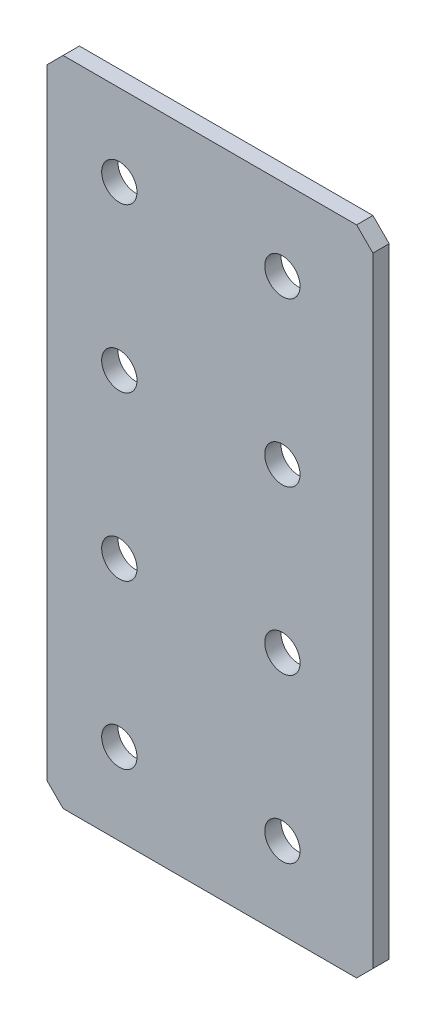
ISO-10303-21;
HEADER;
FILE_DESCRIPTION(('STEP AP214'),'2;1');
FILE_NAME('part.step','',(''),(''),'','','');
FILE_SCHEMA(('AUTOMOTIVE_DESIGN { 1 0 10303 214 1 1 1 1 }'));
ENDSEC;
DATA;
#1=APPLICATION_CONTEXT('core data for automotive mechanical design processes');
#2=APPLICATION_PROTOCOL_DEFINITION('international standard','automotive_design',2000,#1);
#3=PRODUCT_CONTEXT('',#1,'mechanical');
#4=PRODUCT('Part','Part','',(#3));
#5=PRODUCT_RELATED_PRODUCT_CATEGORY('part','',(#4));
#6=PRODUCT_DEFINITION_FORMATION('','',#4);
#7=PRODUCT_DEFINITION_CONTEXT('part definition',#1,'design');
#8=PRODUCT_DEFINITION('design','',#6,#7);
#9=PRODUCT_DEFINITION_SHAPE('','',#8);
#10=(LENGTH_UNIT() NAMED_UNIT(*) SI_UNIT(.MILLI.,.METRE.));
#11=(NAMED_UNIT(*) PLANE_ANGLE_UNIT() SI_UNIT($,.RADIAN.));
#12=(NAMED_UNIT(*) SI_UNIT($,.STERADIAN.) SOLID_ANGLE_UNIT());
#13=UNCERTAINTY_MEASURE_WITH_UNIT(LENGTH_MEASURE(1.E-05),#10,'distance_accuracy_value','');
#14=(GEOMETRIC_REPRESENTATION_CONTEXT(3) GLOBAL_UNCERTAINTY_ASSIGNED_CONTEXT((#13)) GLOBAL_UNIT_ASSIGNED_CONTEXT((#10,
#11,#12)) REPRESENTATION_CONTEXT('',''));
#15=CARTESIAN_POINT('',(0.,0.,0.));
#16=DIRECTION('',(0.,0.,1.));
#17=DIRECTION('',(1.,0.,0.));
#18=AXIS2_PLACEMENT_3D('',#15,#16,#17);
#19=CARTESIAN_POINT('',(0.,0.,3.));
#20=DIRECTION('',(0.,0.,1.));
#21=DIRECTION('',(1.,0.,0.));
#22=AXIS2_PLACEMENT_3D('',#19,#20,#21);
#23=PLANE('',#22);
#24=CARTESIAN_POINT('',(-4.28198785338893,-53.1565274478296,3.));
#25=DIRECTION('',(0.,0.,1.));
#26=DIRECTION('',(1.,0.,0.));
#27=AXIS2_PLACEMENT_3D('',#24,#25,#26);
#28=CIRCLE('',#27,3.25);
#29=CARTESIAN_POINT('',(-1.03198785338893,-53.1565274478296,3.));
#30=VERTEX_POINT('',#29);
#31=EDGE_CURVE('E210',#30,#30,#28,.T.);
#32=ORIENTED_EDGE('',*,*,#31,.F.);
#33=EDGE_LOOP('',(#32));
#34=FACE_BOUND('',#33,.T.);
#35=CARTESIAN_POINT('',(-4.28198785338893,-23.1565274478296,3.));
#36=DIRECTION('',(0.,0.,1.));
#37=DIRECTION('',(1.,0.,0.));
#38=AXIS2_PLACEMENT_3D('',#35,#36,#37);
#39=CIRCLE('',#38,3.25);
#40=CARTESIAN_POINT('',(-1.03198785338893,-23.1565274478296,3.));
#41=VERTEX_POINT('',#40);
#42=EDGE_CURVE('E198',#41,#41,#39,.T.);
#43=ORIENTED_EDGE('',*,*,#42,.F.);
#44=EDGE_LOOP('',(#43));
#45=FACE_BOUND('',#44,.T.);
#46=CARTESIAN_POINT('',(-4.28198785338893,6.84347255217035,3.));
#47=DIRECTION('',(0.,0.,1.));
#48=DIRECTION('',(1.,0.,0.));
#49=AXIS2_PLACEMENT_3D('',#46,#47,#48);
#50=CIRCLE('',#49,3.25);
#51=CARTESIAN_POINT('',(-1.03198785338893,6.84347255217035,3.));
#52=VERTEX_POINT('',#51);
#53=EDGE_CURVE('E186',#52,#52,#50,.T.);
#54=ORIENTED_EDGE('',*,*,#53,.F.);
#55=EDGE_LOOP('',(#54));
#56=FACE_BOUND('',#55,.T.);
#57=CARTESIAN_POINT('',(-4.28198785338893,36.8434725521704,3.));
#58=DIRECTION('',(0.,0.,1.));
#59=DIRECTION('',(1.,0.,0.));
#60=AXIS2_PLACEMENT_3D('',#57,#58,#59);
#61=CIRCLE('',#60,3.25);
#62=CARTESIAN_POINT('',(-1.03198785338893,36.8434725521704,3.));
#63=VERTEX_POINT('',#62);
#64=EDGE_CURVE('E132',#63,#63,#61,.T.);
#65=ORIENTED_EDGE('',*,*,#64,.F.);
#66=EDGE_LOOP('',(#65));
#67=FACE_BOUND('',#66,.T.);
#68=DIRECTION('',(0.,-1.,0.));
#69=VECTOR('',#68,1.);
#70=CARTESIAN_POINT('',(-17.6271186440678,51.8434725521704,3.));
#71=LINE('',#70,#69);
#72=CARTESIAN_POINT('',(-17.6271186440678,48.8434725521703,3.));
#73=VERTEX_POINT('',#72);
#74=CARTESIAN_POINT('',(-17.6271186440678,-65.1565274478296,3.));
#75=VERTEX_POINT('',#74);
#76=EDGE_CURVE('E137',#73,#75,#71,.T.);
#77=ORIENTED_EDGE('',*,*,#76,.T.);
#78=DIRECTION('',(-0.707106781186548,0.707106781186548,0.));
#79=VECTOR('',#78,1.);
#80=CARTESIAN_POINT('',(-41.3918230459487,-41.3918230459487,3.));
#81=LINE('',#80,#79);
#82=CARTESIAN_POINT('',(-14.6271186440677,-68.1565274478296,3.));
#83=VERTEX_POINT('',#82);
#84=EDGE_CURVE('E152',#75,#83,#81,.F.);
#85=ORIENTED_EDGE('',*,*,#84,.T.);
#86=DIRECTION('',(1.,0.,0.));
#87=VECTOR('',#86,1.);
#88=CARTESIAN_POINT('',(-17.6271186440678,-68.1565274478296,3.));
#89=LINE('',#88,#87);
#90=CARTESIAN_POINT('',(39.3728813559322,-68.1565274478296,3.));
#91=VERTEX_POINT('',#90);
#92=EDGE_CURVE('E119',#83,#91,#89,.T.);
#93=ORIENTED_EDGE('',*,*,#92,.T.);
#94=DIRECTION('',(-0.707106781186549,-0.707106781186546,0.));
#95=VECTOR('',#94,1.);
#96=CARTESIAN_POINT('',(53.7647044018808,-53.7647044018811,3.));
#97=LINE('',#96,#95);
#98=CARTESIAN_POINT('',(42.3728813559322,-65.1565274478297,3.));
#99=VERTEX_POINT('',#98);
#100=EDGE_CURVE('E150',#91,#99,#97,.F.);
#101=ORIENTED_EDGE('',*,*,#100,.T.);
#102=DIRECTION('',(0.,1.,0.));
#103=VECTOR('',#102,1.);
#104=CARTESIAN_POINT('',(42.3728813559322,51.8434725521704,3.));
#105=LINE('',#104,#103);
#106=CARTESIAN_POINT('',(42.3728813559322,48.8434725521703,3.));
#107=VERTEX_POINT('',#106);
#108=EDGE_CURVE('E163',#99,#107,#105,.T.);
#109=ORIENTED_EDGE('',*,*,#108,.T.);
#110=DIRECTION('',(0.707106781186548,-0.707106781186548,0.));
#111=VECTOR('',#110,1.);
#112=CARTESIAN_POINT('',(45.6081769540513,45.6081769540513,3.));
#113=LINE('',#112,#111);
#114=CARTESIAN_POINT('',(39.3728813559322,51.8434725521704,3.));
#115=VERTEX_POINT('',#114);
#116=EDGE_CURVE('E54',#107,#115,#113,.F.);
#117=ORIENTED_EDGE('',*,*,#116,.T.);
#118=DIRECTION('',(-1.,0.,0.));
#119=VECTOR('',#118,1.);
#120=CARTESIAN_POINT('',(-17.6271186440678,51.8434725521704,3.));
#121=LINE('',#120,#119);
#122=CARTESIAN_POINT('',(-14.6271186440677,51.8434725521704,3.));
#123=VERTEX_POINT('',#122);
#124=EDGE_CURVE('E138',#115,#123,#121,.T.);
#125=ORIENTED_EDGE('',*,*,#124,.T.);
#126=DIRECTION('',(0.707106781186551,0.707106781186544,0.));
#127=VECTOR('',#126,1.);
#128=CARTESIAN_POINT('',(-33.235295598119,33.2352955981193,3.));
#129=LINE('',#128,#127);
#130=EDGE_CURVE('E147',#123,#73,#129,.F.);
#131=ORIENTED_EDGE('',*,*,#130,.T.);
#132=EDGE_LOOP('',(#77,#85,#93,#101,#109,#117,#125,#131));
#133=FACE_BOUND('',#132,.T.);
#134=CARTESIAN_POINT('',(25.7180121466111,36.8434725521704,3.));
#135=DIRECTION('',(0.,0.,1.));
#136=DIRECTION('',(1.,0.,0.));
#137=AXIS2_PLACEMENT_3D('',#134,#135,#136);
#138=CIRCLE('',#137,3.25);
#139=CARTESIAN_POINT('',(28.9680121466111,36.8434725521704,3.));
#140=VERTEX_POINT('',#139);
#141=EDGE_CURVE('E180',#140,#140,#138,.T.);
#142=ORIENTED_EDGE('',*,*,#141,.F.);
#143=EDGE_LOOP('',(#142));
#144=FACE_BOUND('',#143,.T.);
#145=CARTESIAN_POINT('',(25.7180121466111,6.84347255217035,3.));
#146=DIRECTION('',(0.,0.,1.));
#147=DIRECTION('',(1.,0.,0.));
#148=AXIS2_PLACEMENT_3D('',#145,#146,#147);
#149=CIRCLE('',#148,3.25);
#150=CARTESIAN_POINT('',(28.9680121466111,6.84347255217035,3.));
#151=VERTEX_POINT('',#150);
#152=EDGE_CURVE('E192',#151,#151,#149,.T.);
#153=ORIENTED_EDGE('',*,*,#152,.F.);
#154=EDGE_LOOP('',(#153));
#155=FACE_BOUND('',#154,.T.);
#156=CARTESIAN_POINT('',(25.7180121466111,-23.1565274478296,3.));
#157=DIRECTION('',(0.,0.,1.));
#158=DIRECTION('',(1.,0.,0.));
#159=AXIS2_PLACEMENT_3D('',#156,#157,#158);
#160=CIRCLE('',#159,3.25);
#161=CARTESIAN_POINT('',(28.9680121466111,-23.1565274478296,3.));
#162=VERTEX_POINT('',#161);
#163=EDGE_CURVE('E204',#162,#162,#160,.T.);
#164=ORIENTED_EDGE('',*,*,#163,.F.);
#165=EDGE_LOOP('',(#164));
#166=FACE_BOUND('',#165,.T.);
#167=CARTESIAN_POINT('',(25.7180121466111,-53.1565274478296,3.));
#168=DIRECTION('',(0.,0.,1.));
#169=DIRECTION('',(1.,0.,0.));
#170=AXIS2_PLACEMENT_3D('',#167,#168,#169);
#171=CIRCLE('',#170,3.25);
#172=CARTESIAN_POINT('',(28.9680121466111,-53.1565274478296,3.));
#173=VERTEX_POINT('',#172);
#174=EDGE_CURVE('E216',#173,#173,#171,.T.);
#175=ORIENTED_EDGE('',*,*,#174,.F.);
#176=EDGE_LOOP('',(#175));
#177=FACE_BOUND('',#176,.T.);
#178=ADVANCED_FACE('F33',(#34,#45,#56,#67,#133,#144,#155,#166,#177),#23,.T.);
#179=CARTESIAN_POINT('',(0.,0.,0.));
#180=DIRECTION('',(0.,0.,1.));
#181=DIRECTION('',(1.,0.,0.));
#182=AXIS2_PLACEMENT_3D('',#179,#180,#181);
#183=PLANE('',#182);
#184=DIRECTION('',(1.,0.,0.));
#185=VECTOR('',#184,1.);
#186=CARTESIAN_POINT('',(-17.6271186440678,-68.1565274478296,0.));
#187=LINE('',#186,#185);
#188=CARTESIAN_POINT('',(-14.6271186440677,-68.1565274478296,0.));
#189=VERTEX_POINT('',#188);
#190=CARTESIAN_POINT('',(39.3728813559322,-68.1565274478296,0.));
#191=VERTEX_POINT('',#190);
#192=EDGE_CURVE('E116',#189,#191,#187,.T.);
#193=ORIENTED_EDGE('',*,*,#192,.F.);
#194=DIRECTION('',(0.707106781186548,-0.707106781186548,0.));
#195=VECTOR('',#194,1.);
#196=CARTESIAN_POINT('',(-14.6271186440677,-68.1565274478296,0.));
#197=LINE('',#196,#195);
#198=CARTESIAN_POINT('',(-17.6271186440678,-65.1565274478296,0.));
#199=VERTEX_POINT('',#198);
#200=EDGE_CURVE('E99',#189,#199,#197,.F.);
#201=ORIENTED_EDGE('',*,*,#200,.T.);
#202=DIRECTION('',(0.,-1.,0.));
#203=VECTOR('',#202,1.);
#204=CARTESIAN_POINT('',(-17.6271186440678,51.8434725521704,0.));
#205=LINE('',#204,#203);
#206=CARTESIAN_POINT('',(-17.6271186440678,48.8434725521703,0.));
#207=VERTEX_POINT('',#206);
#208=EDGE_CURVE('E127',#207,#199,#205,.T.);
#209=ORIENTED_EDGE('',*,*,#208,.F.);
#210=DIRECTION('',(-0.707106781186551,-0.707106781186544,0.));
#211=VECTOR('',#210,1.);
#212=CARTESIAN_POINT('',(-17.6271186440678,48.8434725521703,0.));
#213=LINE('',#212,#211);
#214=CARTESIAN_POINT('',(-14.6271186440677,51.8434725521704,0.));
#215=VERTEX_POINT('',#214);
#216=EDGE_CURVE('E120',#207,#215,#213,.F.);
#217=ORIENTED_EDGE('',*,*,#216,.T.);
#218=DIRECTION('',(-1.,0.,0.));
#219=VECTOR('',#218,1.);
#220=CARTESIAN_POINT('',(-17.6271186440678,51.8434725521704,0.));
#221=LINE('',#220,#219);
#222=CARTESIAN_POINT('',(39.3728813559322,51.8434725521704,0.));
#223=VERTEX_POINT('',#222);
#224=EDGE_CURVE('E130',#223,#215,#221,.T.);
#225=ORIENTED_EDGE('',*,*,#224,.F.);
#226=DIRECTION('',(-0.707106781186548,0.707106781186548,0.));
#227=VECTOR('',#226,1.);
#228=CARTESIAN_POINT('',(39.3728813559322,51.8434725521704,0.));
#229=LINE('',#228,#227);
#230=CARTESIAN_POINT('',(42.3728813559322,48.8434725521703,0.));
#231=VERTEX_POINT('',#230);
#232=EDGE_CURVE('E141',#223,#231,#229,.F.);
#233=ORIENTED_EDGE('',*,*,#232,.T.);
#234=DIRECTION('',(0.,1.,0.));
#235=VECTOR('',#234,1.);
#236=CARTESIAN_POINT('',(42.3728813559322,51.8434725521704,0.));
#237=LINE('',#236,#235);
#238=CARTESIAN_POINT('',(42.3728813559322,-65.1565274478297,0.));
#239=VERTEX_POINT('',#238);
#240=EDGE_CURVE('E126',#239,#231,#237,.T.);
#241=ORIENTED_EDGE('',*,*,#240,.F.);
#242=DIRECTION('',(0.707106781186549,0.707106781186546,0.));
#243=VECTOR('',#242,1.);
#244=CARTESIAN_POINT('',(42.3728813559322,-65.1565274478297,0.));
#245=LINE('',#244,#243);
#246=EDGE_CURVE('E110',#239,#191,#245,.F.);
#247=ORIENTED_EDGE('',*,*,#246,.T.);
#248=EDGE_LOOP('',(#193,#201,#209,#217,#225,#233,#241,#247));
#249=FACE_BOUND('',#248,.T.);
#250=CARTESIAN_POINT('',(-4.28198785338893,36.8434725521704,0.));
#251=DIRECTION('',(0.,0.,1.));
#252=DIRECTION('',(1.,0.,0.));
#253=AXIS2_PLACEMENT_3D('',#250,#251,#252);
#254=CIRCLE('',#253,3.25);
#255=CARTESIAN_POINT('',(-1.03198785338893,36.8434725521704,0.));
#256=VERTEX_POINT('',#255);
#257=EDGE_CURVE('E177',#256,#256,#254,.T.);
#258=ORIENTED_EDGE('',*,*,#257,.T.);
#259=EDGE_LOOP('',(#258));
#260=FACE_BOUND('',#259,.T.);
#261=CARTESIAN_POINT('',(25.7180121466111,36.8434725521704,0.));
#262=DIRECTION('',(0.,0.,1.));
#263=DIRECTION('',(1.,0.,0.));
#264=AXIS2_PLACEMENT_3D('',#261,#262,#263);
#265=CIRCLE('',#264,3.25);
#266=CARTESIAN_POINT('',(28.9680121466111,36.8434725521704,0.));
#267=VERTEX_POINT('',#266);
#268=EDGE_CURVE('E183',#267,#267,#265,.T.);
#269=ORIENTED_EDGE('',*,*,#268,.T.);
#270=EDGE_LOOP('',(#269));
#271=FACE_BOUND('',#270,.T.);
#272=CARTESIAN_POINT('',(-4.28198785338893,6.84347255217035,0.));
#273=DIRECTION('',(0.,0.,1.));
#274=DIRECTION('',(1.,0.,0.));
#275=AXIS2_PLACEMENT_3D('',#272,#273,#274);
#276=CIRCLE('',#275,3.25);
#277=CARTESIAN_POINT('',(-1.03198785338893,6.84347255217035,0.));
#278=VERTEX_POINT('',#277);
#279=EDGE_CURVE('E189',#278,#278,#276,.T.);
#280=ORIENTED_EDGE('',*,*,#279,.T.);
#281=EDGE_LOOP('',(#280));
#282=FACE_BOUND('',#281,.T.);
#283=CARTESIAN_POINT('',(25.7180121466111,6.84347255217035,0.));
#284=DIRECTION('',(0.,0.,1.));
#285=DIRECTION('',(1.,0.,0.));
#286=AXIS2_PLACEMENT_3D('',#283,#284,#285);
#287=CIRCLE('',#286,3.25);
#288=CARTESIAN_POINT('',(28.9680121466111,6.84347255217035,0.));
#289=VERTEX_POINT('',#288);
#290=EDGE_CURVE('E195',#289,#289,#287,.T.);
#291=ORIENTED_EDGE('',*,*,#290,.T.);
#292=EDGE_LOOP('',(#291));
#293=FACE_BOUND('',#292,.T.);
#294=CARTESIAN_POINT('',(-4.28198785338893,-23.1565274478296,0.));
#295=DIRECTION('',(0.,0.,1.));
#296=DIRECTION('',(1.,0.,0.));
#297=AXIS2_PLACEMENT_3D('',#294,#295,#296);
#298=CIRCLE('',#297,3.25);
#299=CARTESIAN_POINT('',(-1.03198785338893,-23.1565274478296,0.));
#300=VERTEX_POINT('',#299);
#301=EDGE_CURVE('E201',#300,#300,#298,.T.);
#302=ORIENTED_EDGE('',*,*,#301,.T.);
#303=EDGE_LOOP('',(#302));
#304=FACE_BOUND('',#303,.T.);
#305=CARTESIAN_POINT('',(25.7180121466111,-23.1565274478296,0.));
#306=DIRECTION('',(0.,0.,1.));
#307=DIRECTION('',(1.,0.,0.));
#308=AXIS2_PLACEMENT_3D('',#305,#306,#307);
#309=CIRCLE('',#308,3.25);
#310=CARTESIAN_POINT('',(28.9680121466111,-23.1565274478296,0.));
#311=VERTEX_POINT('',#310);
#312=EDGE_CURVE('E207',#311,#311,#309,.T.);
#313=ORIENTED_EDGE('',*,*,#312,.T.);
#314=EDGE_LOOP('',(#313));
#315=FACE_BOUND('',#314,.T.);
#316=CARTESIAN_POINT('',(-4.28198785338893,-53.1565274478296,0.));
#317=DIRECTION('',(0.,0.,1.));
#318=DIRECTION('',(1.,0.,0.));
#319=AXIS2_PLACEMENT_3D('',#316,#317,#318);
#320=CIRCLE('',#319,3.25);
#321=CARTESIAN_POINT('',(-1.03198785338893,-53.1565274478296,0.));
#322=VERTEX_POINT('',#321);
#323=EDGE_CURVE('E213',#322,#322,#320,.T.);
#324=ORIENTED_EDGE('',*,*,#323,.T.);
#325=EDGE_LOOP('',(#324));
#326=FACE_BOUND('',#325,.T.);
#327=CARTESIAN_POINT('',(25.7180121466111,-53.1565274478296,0.));
#328=DIRECTION('',(0.,0.,1.));
#329=DIRECTION('',(1.,0.,0.));
#330=AXIS2_PLACEMENT_3D('',#327,#328,#329);
#331=CIRCLE('',#330,3.25);
#332=CARTESIAN_POINT('',(28.9680121466111,-53.1565274478296,0.));
#333=VERTEX_POINT('',#332);
#334=EDGE_CURVE('E219',#333,#333,#331,.T.);
#335=ORIENTED_EDGE('',*,*,#334,.T.);
#336=EDGE_LOOP('',(#335));
#337=FACE_BOUND('',#336,.T.);
#338=ADVANCED_FACE('F123',(#249,#260,#271,#282,#293,#304,#315,#326,#337),#183,.F.);
#339=CARTESIAN_POINT('',(-17.6271186440678,51.8434725521704,3.));
#340=DIRECTION('',(1.,0.,0.));
#341=DIRECTION('',(0.,1.,0.));
#342=AXIS2_PLACEMENT_3D('',#339,#340,#341);
#343=PLANE('',#342);
#344=ORIENTED_EDGE('',*,*,#208,.T.);
#345=DIRECTION('',(0.,0.,1.));
#346=VECTOR('',#345,1.);
#347=CARTESIAN_POINT('',(-17.6271186440678,-65.1565274478296,3.));
#348=LINE('',#347,#346);
#349=EDGE_CURVE('E104',#199,#75,#348,.T.);
#350=ORIENTED_EDGE('',*,*,#349,.T.);
#351=ORIENTED_EDGE('',*,*,#76,.F.);
#352=DIRECTION('',(0.,0.,-1.));
#353=VECTOR('',#352,1.);
#354=CARTESIAN_POINT('',(-17.6271186440678,48.8434725521703,3.));
#355=LINE('',#354,#353);
#356=EDGE_CURVE('E109',#73,#207,#355,.T.);
#357=ORIENTED_EDGE('',*,*,#356,.T.);
#358=EDGE_LOOP('',(#344,#350,#351,#357));
#359=FACE_BOUND('',#358,.T.);
#360=ADVANCED_FACE('F234',(#359),#343,.F.);
#361=CARTESIAN_POINT('',(-17.6271186440678,-68.1565274478296,3.));
#362=DIRECTION('',(0.,1.,0.));
#363=DIRECTION('',(0.,0.,1.));
#364=AXIS2_PLACEMENT_3D('',#361,#362,#363);
#365=PLANE('',#364);
#366=ORIENTED_EDGE('',*,*,#92,.F.);
#367=DIRECTION('',(0.,0.,-1.));
#368=VECTOR('',#367,1.);
#369=CARTESIAN_POINT('',(-14.6271186440677,-68.1565274478296,3.));
#370=LINE('',#369,#368);
#371=EDGE_CURVE('E103',#83,#189,#370,.T.);
#372=ORIENTED_EDGE('',*,*,#371,.T.);
#373=ORIENTED_EDGE('',*,*,#192,.T.);
#374=DIRECTION('',(0.,0.,1.));
#375=VECTOR('',#374,1.);
#376=CARTESIAN_POINT('',(39.3728813559322,-68.1565274478296,3.));
#377=LINE('',#376,#375);
#378=EDGE_CURVE('E121',#191,#91,#377,.T.);
#379=ORIENTED_EDGE('',*,*,#378,.T.);
#380=EDGE_LOOP('',(#366,#372,#373,#379));
#381=FACE_BOUND('',#380,.T.);
#382=ADVANCED_FACE('F115',(#381),#365,.F.);
#383=CARTESIAN_POINT('',(42.3728813559322,51.8434725521704,3.));
#384=DIRECTION('',(-1.,0.,0.));
#385=DIRECTION('',(0.,-1.,0.));
#386=AXIS2_PLACEMENT_3D('',#383,#384,#385);
#387=PLANE('',#386);
#388=ORIENTED_EDGE('',*,*,#108,.F.);
#389=DIRECTION('',(0.,0.,-1.));
#390=VECTOR('',#389,1.);
#391=CARTESIAN_POINT('',(42.3728813559322,-65.1565274478297,3.));
#392=LINE('',#391,#390);
#393=EDGE_CURVE('E156',#99,#239,#392,.T.);
#394=ORIENTED_EDGE('',*,*,#393,.T.);
#395=ORIENTED_EDGE('',*,*,#240,.T.);
#396=DIRECTION('',(0.,0.,1.));
#397=VECTOR('',#396,1.);
#398=CARTESIAN_POINT('',(42.3728813559322,48.8434725521703,3.));
#399=LINE('',#398,#397);
#400=EDGE_CURVE('E154',#231,#107,#399,.T.);
#401=ORIENTED_EDGE('',*,*,#400,.T.);
#402=EDGE_LOOP('',(#388,#394,#395,#401));
#403=FACE_BOUND('',#402,.T.);
#404=ADVANCED_FACE('F161',(#403),#387,.F.);
#405=CARTESIAN_POINT('',(-17.6271186440678,51.8434725521704,3.));
#406=DIRECTION('',(0.,-1.,0.));
#407=DIRECTION('',(0.,0.,-1.));
#408=AXIS2_PLACEMENT_3D('',#405,#406,#407);
#409=PLANE('',#408);
#410=ORIENTED_EDGE('',*,*,#124,.F.);
#411=DIRECTION('',(0.,0.,-1.));
#412=VECTOR('',#411,1.);
#413=CARTESIAN_POINT('',(39.3728813559322,51.8434725521704,3.));
#414=LINE('',#413,#412);
#415=EDGE_CURVE('E11',#115,#223,#414,.T.);
#416=ORIENTED_EDGE('',*,*,#415,.T.);
#417=ORIENTED_EDGE('',*,*,#224,.T.);
#418=DIRECTION('',(0.,0.,1.));
#419=VECTOR('',#418,1.);
#420=CARTESIAN_POINT('',(-14.6271186440677,51.8434725521704,3.));
#421=LINE('',#420,#419);
#422=EDGE_CURVE('E41',#215,#123,#421,.T.);
#423=ORIENTED_EDGE('',*,*,#422,.T.);
#424=EDGE_LOOP('',(#410,#416,#417,#423));
#425=FACE_BOUND('',#424,.T.);
#426=ADVANCED_FACE('F170',(#425),#409,.F.);
#427=CARTESIAN_POINT('',(-4.28198785338893,36.8434725521704,3.));
#428=DIRECTION('',(0.,0.,-1.));
#429=DIRECTION('',(-1.,0.,0.));
#430=AXIS2_PLACEMENT_3D('',#427,#428,#429);
#431=CYLINDRICAL_SURFACE('',#430,3.25);
#432=ORIENTED_EDGE('',*,*,#64,.T.);
#433=EDGE_LOOP('',(#432));
#434=FACE_BOUND('',#433,.T.);
#435=ORIENTED_EDGE('',*,*,#257,.F.);
#436=EDGE_LOOP('',(#435));
#437=FACE_BOUND('',#436,.T.);
#438=ADVANCED_FACE('F239',(#434,#437),#431,.F.);
#439=CARTESIAN_POINT('',(25.7180121466111,36.8434725521704,3.));
#440=DIRECTION('',(0.,0.,-1.));
#441=DIRECTION('',(-1.,0.,0.));
#442=AXIS2_PLACEMENT_3D('',#439,#440,#441);
#443=CYLINDRICAL_SURFACE('',#442,3.25);
#444=ORIENTED_EDGE('',*,*,#141,.T.);
#445=EDGE_LOOP('',(#444));
#446=FACE_BOUND('',#445,.T.);
#447=ORIENTED_EDGE('',*,*,#268,.F.);
#448=EDGE_LOOP('',(#447));
#449=FACE_BOUND('',#448,.T.);
#450=ADVANCED_FACE('F300',(#446,#449),#443,.F.);
#451=CARTESIAN_POINT('',(-4.28198785338893,6.84347255217035,3.));
#452=DIRECTION('',(0.,0.,-1.));
#453=DIRECTION('',(-1.,0.,0.));
#454=AXIS2_PLACEMENT_3D('',#451,#452,#453);
#455=CYLINDRICAL_SURFACE('',#454,3.25);
#456=ORIENTED_EDGE('',*,*,#53,.T.);
#457=EDGE_LOOP('',(#456));
#458=FACE_BOUND('',#457,.T.);
#459=ORIENTED_EDGE('',*,*,#279,.F.);
#460=EDGE_LOOP('',(#459));
#461=FACE_BOUND('',#460,.T.);
#462=ADVANCED_FACE('F297',(#458,#461),#455,.F.);
#463=CARTESIAN_POINT('',(25.7180121466111,6.84347255217035,3.));
#464=DIRECTION('',(0.,0.,-1.));
#465=DIRECTION('',(-1.,0.,0.));
#466=AXIS2_PLACEMENT_3D('',#463,#464,#465);
#467=CYLINDRICAL_SURFACE('',#466,3.25);
#468=ORIENTED_EDGE('',*,*,#152,.T.);
#469=EDGE_LOOP('',(#468));
#470=FACE_BOUND('',#469,.T.);
#471=ORIENTED_EDGE('',*,*,#290,.F.);
#472=EDGE_LOOP('',(#471));
#473=FACE_BOUND('',#472,.T.);
#474=ADVANCED_FACE('F293',(#470,#473),#467,.F.);
#475=CARTESIAN_POINT('',(-4.28198785338893,-23.1565274478296,3.));
#476=DIRECTION('',(0.,0.,-1.));
#477=DIRECTION('',(-1.,0.,0.));
#478=AXIS2_PLACEMENT_3D('',#475,#476,#477);
#479=CYLINDRICAL_SURFACE('',#478,3.25);
#480=ORIENTED_EDGE('',*,*,#42,.T.);
#481=EDGE_LOOP('',(#480));
#482=FACE_BOUND('',#481,.T.);
#483=ORIENTED_EDGE('',*,*,#301,.F.);
#484=EDGE_LOOP('',(#483));
#485=FACE_BOUND('',#484,.T.);
#486=ADVANCED_FACE('F275',(#482,#485),#479,.F.);
#487=CARTESIAN_POINT('',(25.7180121466111,-23.1565274478296,3.));
#488=DIRECTION('',(0.,0.,-1.));
#489=DIRECTION('',(-1.,0.,0.));
#490=AXIS2_PLACEMENT_3D('',#487,#488,#489);
#491=CYLINDRICAL_SURFACE('',#490,3.25);
#492=ORIENTED_EDGE('',*,*,#163,.T.);
#493=EDGE_LOOP('',(#492));
#494=FACE_BOUND('',#493,.T.);
#495=ORIENTED_EDGE('',*,*,#312,.F.);
#496=EDGE_LOOP('',(#495));
#497=FACE_BOUND('',#496,.T.);
#498=ADVANCED_FACE('F271',(#494,#497),#491,.F.);
#499=CARTESIAN_POINT('',(-4.28198785338893,-53.1565274478296,3.));
#500=DIRECTION('',(0.,0.,-1.));
#501=DIRECTION('',(-1.,0.,0.));
#502=AXIS2_PLACEMENT_3D('',#499,#500,#501);
#503=CYLINDRICAL_SURFACE('',#502,3.25);
#504=ORIENTED_EDGE('',*,*,#31,.T.);
#505=EDGE_LOOP('',(#504));
#506=FACE_BOUND('',#505,.T.);
#507=ORIENTED_EDGE('',*,*,#323,.F.);
#508=EDGE_LOOP('',(#507));
#509=FACE_BOUND('',#508,.T.);
#510=ADVANCED_FACE('F274',(#506,#509),#503,.F.);
#511=CARTESIAN_POINT('',(25.7180121466111,-53.1565274478296,3.));
#512=DIRECTION('',(0.,0.,-1.));
#513=DIRECTION('',(-1.,0.,0.));
#514=AXIS2_PLACEMENT_3D('',#511,#512,#513);
#515=CYLINDRICAL_SURFACE('',#514,3.25);
#516=ORIENTED_EDGE('',*,*,#174,.T.);
#517=EDGE_LOOP('',(#516));
#518=FACE_BOUND('',#517,.T.);
#519=ORIENTED_EDGE('',*,*,#334,.F.);
#520=EDGE_LOOP('',(#519));
#521=FACE_BOUND('',#520,.T.);
#522=ADVANCED_FACE('F225',(#518,#521),#515,.F.);
#523=CARTESIAN_POINT('',(-14.6271186440677,-68.1565274478296,3.));
#524=DIRECTION('',(0.707106781186547,0.707106781186547,0.));
#525=DIRECTION('',(0.,0.,-1.));
#526=AXIS2_PLACEMENT_3D('',#523,#524,#525);
#527=PLANE('',#526);
#528=ORIENTED_EDGE('',*,*,#84,.F.);
#529=ORIENTED_EDGE('',*,*,#349,.F.);
#530=ORIENTED_EDGE('',*,*,#200,.F.);
#531=ORIENTED_EDGE('',*,*,#371,.F.);
#532=EDGE_LOOP('',(#528,#529,#530,#531));
#533=FACE_BOUND('',#532,.T.);
#534=ADVANCED_FACE('F102',(#533),#527,.F.);
#535=CARTESIAN_POINT('',(42.3728813559322,-65.1565274478297,3.));
#536=DIRECTION('',(-0.707106781186546,0.707106781186549,0.));
#537=DIRECTION('',(0.,0.,-1.));
#538=AXIS2_PLACEMENT_3D('',#535,#536,#537);
#539=PLANE('',#538);
#540=ORIENTED_EDGE('',*,*,#100,.F.);
#541=ORIENTED_EDGE('',*,*,#378,.F.);
#542=ORIENTED_EDGE('',*,*,#246,.F.);
#543=ORIENTED_EDGE('',*,*,#393,.F.);
#544=EDGE_LOOP('',(#540,#541,#542,#543));
#545=FACE_BOUND('',#544,.T.);
#546=ADVANCED_FACE('F253',(#545),#539,.F.);
#547=CARTESIAN_POINT('',(39.3728813559322,51.8434725521704,3.));
#548=DIRECTION('',(-0.707106781186547,-0.707106781186547,0.));
#549=DIRECTION('',(0.,0.,-1.));
#550=AXIS2_PLACEMENT_3D('',#547,#548,#549);
#551=PLANE('',#550);
#552=ORIENTED_EDGE('',*,*,#116,.F.);
#553=ORIENTED_EDGE('',*,*,#400,.F.);
#554=ORIENTED_EDGE('',*,*,#232,.F.);
#555=ORIENTED_EDGE('',*,*,#415,.F.);
#556=EDGE_LOOP('',(#552,#553,#554,#555));
#557=FACE_BOUND('',#556,.T.);
#558=ADVANCED_FACE('F169',(#557),#551,.F.);
#559=CARTESIAN_POINT('',(-17.6271186440678,48.8434725521703,3.));
#560=DIRECTION('',(0.707106781186544,-0.707106781186551,0.));
#561=DIRECTION('',(0.,0.,-1.));
#562=AXIS2_PLACEMENT_3D('',#559,#560,#561);
#563=PLANE('',#562);
#564=ORIENTED_EDGE('',*,*,#130,.F.);
#565=ORIENTED_EDGE('',*,*,#422,.F.);
#566=ORIENTED_EDGE('',*,*,#216,.F.);
#567=ORIENTED_EDGE('',*,*,#356,.F.);
#568=EDGE_LOOP('',(#564,#565,#566,#567));
#569=FACE_BOUND('',#568,.T.);
#570=ADVANCED_FACE('F35',(#569),#563,.F.);
#571=CLOSED_SHELL('',(#178,#338,#360,#382,#404,#426,#438,#450,#462,#474,#486,#498,#510,#522,
#534,#546,#558,#570));
#572=MANIFOLD_SOLID_BREP('B2',#571);
#573=ADVANCED_BREP_SHAPE_REPRESENTATION('',(#18,#572),#14);
#574=SHAPE_DEFINITION_REPRESENTATION(#9,#573);
ENDSEC;
END-ISO-10303-21;
